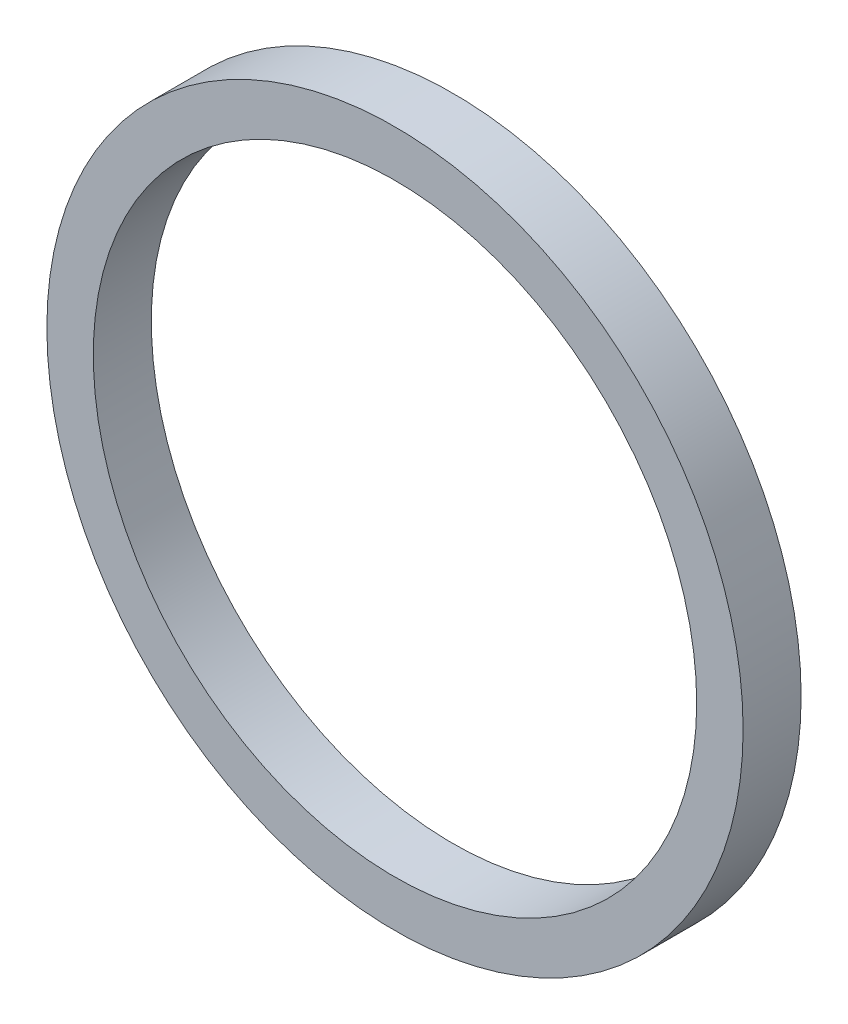
ISO-10303-21;
HEADER;
FILE_DESCRIPTION(('STEP AP214'),'2;1');
FILE_NAME('part.step','',(''),(''),'','','');
FILE_SCHEMA(('AUTOMOTIVE_DESIGN { 1 0 10303 214 1 1 1 1 }'));
ENDSEC;
DATA;
#1=APPLICATION_CONTEXT('core data for automotive mechanical design processes');
#2=APPLICATION_PROTOCOL_DEFINITION('international standard','automotive_design',2000,#1);
#3=PRODUCT_CONTEXT('',#1,'mechanical');
#4=PRODUCT('Part','Part','',(#3));
#5=PRODUCT_RELATED_PRODUCT_CATEGORY('part','',(#4));
#6=PRODUCT_DEFINITION_FORMATION('','',#4);
#7=PRODUCT_DEFINITION_CONTEXT('part definition',#1,'design');
#8=PRODUCT_DEFINITION('design','',#6,#7);
#9=PRODUCT_DEFINITION_SHAPE('','',#8);
#10=(LENGTH_UNIT() NAMED_UNIT(*) SI_UNIT(.MILLI.,.METRE.));
#11=(NAMED_UNIT(*) PLANE_ANGLE_UNIT() SI_UNIT($,.RADIAN.));
#12=(NAMED_UNIT(*) SI_UNIT($,.STERADIAN.) SOLID_ANGLE_UNIT());
#13=UNCERTAINTY_MEASURE_WITH_UNIT(LENGTH_MEASURE(1.E-05),#10,'distance_accuracy_value','');
#14=(GEOMETRIC_REPRESENTATION_CONTEXT(3) GLOBAL_UNCERTAINTY_ASSIGNED_CONTEXT((#13)) GLOBAL_UNIT_ASSIGNED_CONTEXT((#10,
#11,#12)) REPRESENTATION_CONTEXT('',''));
#15=CARTESIAN_POINT('',(0.,0.,0.));
#16=DIRECTION('',(0.,0.,1.));
#17=DIRECTION('',(1.,0.,0.));
#18=AXIS2_PLACEMENT_3D('',#15,#16,#17);
#19=CARTESIAN_POINT('',(0.,0.,3.175));
#20=DIRECTION('',(0.,0.,1.));
#21=DIRECTION('',(1.,0.,0.));
#22=AXIS2_PLACEMENT_3D('',#19,#20,#21);
#23=PLANE('',#22);
#24=CARTESIAN_POINT('',(0.,0.,3.175));
#25=DIRECTION('',(0.,0.,1.));
#26=DIRECTION('',(1.,0.,0.));
#27=AXIS2_PLACEMENT_3D('',#24,#25,#26);
#28=CIRCLE('',#27,19.05);
#29=CARTESIAN_POINT('',(19.05,0.,3.175));
#30=VERTEX_POINT('',#29);
#31=EDGE_CURVE('E10',#30,#30,#28,.T.);
#32=ORIENTED_EDGE('',*,*,#31,.T.);
#33=EDGE_LOOP('',(#32));
#34=FACE_BOUND('',#33,.T.);
#35=CARTESIAN_POINT('',(0.,0.,3.175));
#36=DIRECTION('',(0.,0.,1.));
#37=DIRECTION('',(1.,0.,0.));
#38=AXIS2_PLACEMENT_3D('',#35,#36,#37);
#39=CIRCLE('',#38,16.51);
#40=CARTESIAN_POINT('',(16.51,0.,3.175));
#41=VERTEX_POINT('',#40);
#42=EDGE_CURVE('E46',#41,#41,#39,.T.);
#43=ORIENTED_EDGE('',*,*,#42,.F.);
#44=EDGE_LOOP('',(#43));
#45=FACE_BOUND('',#44,.T.);
#46=ADVANCED_FACE('F35',(#34,#45),#23,.T.);
#47=CARTESIAN_POINT('',(0.,0.,0.));
#48=DIRECTION('',(0.,0.,1.));
#49=DIRECTION('',(1.,0.,0.));
#50=AXIS2_PLACEMENT_3D('',#47,#48,#49);
#51=PLANE('',#50);
#52=CARTESIAN_POINT('',(0.,0.,0.));
#53=DIRECTION('',(0.,0.,1.));
#54=DIRECTION('',(1.,0.,0.));
#55=AXIS2_PLACEMENT_3D('',#52,#53,#54);
#56=CIRCLE('',#55,19.05);
#57=CARTESIAN_POINT('',(19.05,0.,0.));
#58=VERTEX_POINT('',#57);
#59=EDGE_CURVE('E39',#58,#58,#56,.T.);
#60=ORIENTED_EDGE('',*,*,#59,.F.);
#61=EDGE_LOOP('',(#60));
#62=FACE_BOUND('',#61,.T.);
#63=CARTESIAN_POINT('',(0.,0.,0.));
#64=DIRECTION('',(0.,0.,1.));
#65=DIRECTION('',(1.,0.,0.));
#66=AXIS2_PLACEMENT_3D('',#63,#64,#65);
#67=CIRCLE('',#66,16.51);
#68=CARTESIAN_POINT('',(16.51,0.,0.));
#69=VERTEX_POINT('',#68);
#70=EDGE_CURVE('E48',#69,#69,#67,.T.);
#71=ORIENTED_EDGE('',*,*,#70,.T.);
#72=EDGE_LOOP('',(#71));
#73=FACE_BOUND('',#72,.T.);
#74=ADVANCED_FACE('F58',(#62,#73),#51,.F.);
#75=CARTESIAN_POINT('',(0.,0.,3.175));
#76=DIRECTION('',(0.,0.,-1.));
#77=DIRECTION('',(-1.,0.,0.));
#78=AXIS2_PLACEMENT_3D('',#75,#76,#77);
#79=CYLINDRICAL_SURFACE('',#78,19.05);
#80=ORIENTED_EDGE('',*,*,#31,.F.);
#81=EDGE_LOOP('',(#80));
#82=FACE_BOUND('',#81,.T.);
#83=ORIENTED_EDGE('',*,*,#59,.T.);
#84=EDGE_LOOP('',(#83));
#85=FACE_BOUND('',#84,.T.);
#86=ADVANCED_FACE('F37',(#82,#85),#79,.T.);
#87=CARTESIAN_POINT('',(0.,0.,3.175));
#88=DIRECTION('',(0.,0.,-1.));
#89=DIRECTION('',(-1.,0.,0.));
#90=AXIS2_PLACEMENT_3D('',#87,#88,#89);
#91=CYLINDRICAL_SURFACE('',#90,16.51);
#92=ORIENTED_EDGE('',*,*,#42,.T.);
#93=EDGE_LOOP('',(#92));
#94=FACE_BOUND('',#93,.T.);
#95=ORIENTED_EDGE('',*,*,#70,.F.);
#96=EDGE_LOOP('',(#95));
#97=FACE_BOUND('',#96,.T.);
#98=ADVANCED_FACE('F54',(#94,#97),#91,.F.);
#99=CLOSED_SHELL('',(#46,#74,#86,#98));
#100=MANIFOLD_SOLID_BREP('B2',#99);
#101=ADVANCED_BREP_SHAPE_REPRESENTATION('',(#18,#100),#14);
#102=SHAPE_DEFINITION_REPRESENTATION(#9,#101);
ENDSEC;
END-ISO-10303-21;
